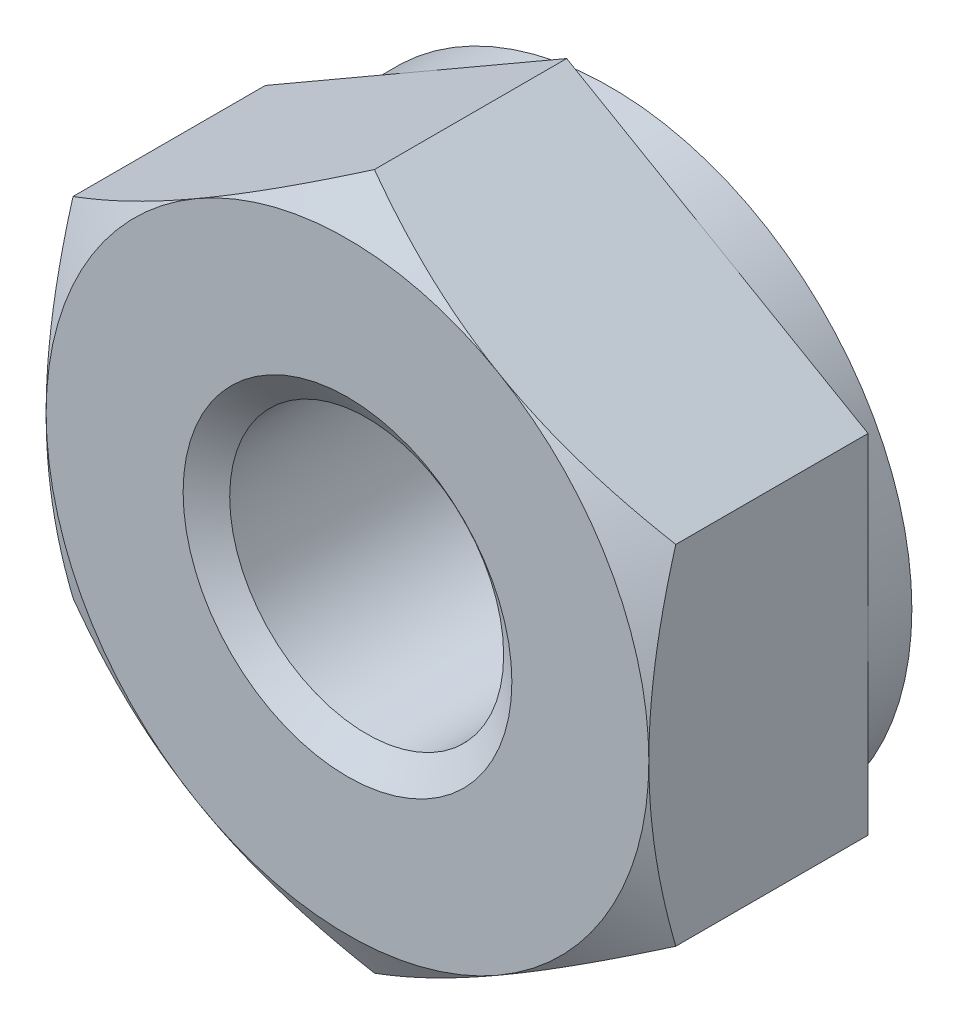
ISO-10303-21;
HEADER;
FILE_DESCRIPTION(('STEP AP214'),'2;1');
FILE_NAME('part.step','',(''),(''),'','','');
FILE_SCHEMA(('AUTOMOTIVE_DESIGN { 1 0 10303 214 1 1 1 1 }'));
ENDSEC;
DATA;
#1=APPLICATION_CONTEXT('core data for automotive mechanical design processes');
#2=APPLICATION_PROTOCOL_DEFINITION('international standard','automotive_design',2000,#1);
#3=PRODUCT_CONTEXT('',#1,'mechanical');
#4=PRODUCT('Part','Part','',(#3));
#5=PRODUCT_RELATED_PRODUCT_CATEGORY('part','',(#4));
#6=PRODUCT_DEFINITION_FORMATION('','',#4);
#7=PRODUCT_DEFINITION_CONTEXT('part definition',#1,'design');
#8=PRODUCT_DEFINITION('design','',#6,#7);
#9=PRODUCT_DEFINITION_SHAPE('','',#8);
#10=(LENGTH_UNIT() NAMED_UNIT(*) SI_UNIT(.MILLI.,.METRE.));
#11=(NAMED_UNIT(*) PLANE_ANGLE_UNIT() SI_UNIT($,.RADIAN.));
#12=(NAMED_UNIT(*) SI_UNIT($,.STERADIAN.) SOLID_ANGLE_UNIT());
#13=UNCERTAINTY_MEASURE_WITH_UNIT(LENGTH_MEASURE(1.E-05),#10,'distance_accuracy_value','');
#14=(GEOMETRIC_REPRESENTATION_CONTEXT(3) GLOBAL_UNCERTAINTY_ASSIGNED_CONTEXT((#13)) GLOBAL_UNIT_ASSIGNED_CONTEXT((#10,
#11,#12)) REPRESENTATION_CONTEXT('',''));
#15=CARTESIAN_POINT('',(0.,0.,0.));
#16=DIRECTION('',(0.,0.,1.));
#17=DIRECTION('',(1.,0.,0.));
#18=AXIS2_PLACEMENT_3D('',#15,#16,#17);
#19=CARTESIAN_POINT('',(0.,3.175426481,-2.));
#20=DIRECTION('',(-0.50000000017207,0.866025403685094,0.));
#21=DIRECTION('',(-0.866025403685094,-0.50000000017207,0.));
#22=AXIS2_PLACEMENT_3D('',#19,#20,#21);
#23=PLANE('',#22);
#24=DIRECTION('',(-0.866025403685094,-0.50000000017207,0.));
#25=VECTOR('',#24,1.);
#26=CARTESIAN_POINT('',(-1.375,2.3815698605,-2.));
#27=LINE('',#26,#25);
#28=CARTESIAN_POINT('',(0.,3.175426481,-2.));
#29=VERTEX_POINT('',#28);
#30=CARTESIAN_POINT('',(-1.37499999978847,2.38156986057573,-2.));
#31=VERTEX_POINT('',#30);
#32=EDGE_CURVE('E150',#29,#31,#27,.T.);
#33=ORIENTED_EDGE('',*,*,#32,.T.);
#34=DIRECTION('',(-0.866025403685094,-0.50000000017207,0.));
#35=VECTOR('',#34,1.);
#36=CARTESIAN_POINT('',(-1.375,2.3815698605,-2.));
#37=LINE('',#36,#35);
#38=CARTESIAN_POINT('',(-2.75,1.58771324,-2.));
#39=VERTEX_POINT('',#38);
#40=EDGE_CURVE('E96',#31,#39,#37,.T.);
#41=ORIENTED_EDGE('',*,*,#40,.T.);
#42=DIRECTION('',(0.,0.,-1.));
#43=VECTOR('',#42,1.);
#44=CARTESIAN_POINT('',(-2.75,1.58771324,-0.994));
#45=LINE('',#44,#43);
#46=CARTESIAN_POINT('',(-2.74999999999382,1.58771323999643,-0.245620093601473));
#47=VERTEX_POINT('',#46);
#48=EDGE_CURVE('E291',#47,#39,#45,.T.);
#49=ORIENTED_EDGE('',*,*,#48,.F.);
#50=CARTESIAN_POINT('',(-2.74999999999408,1.58771324001485,-0.245620093595487));
#51=CARTESIAN_POINT('',(-2.63807558585393,1.65233283066977,-0.208302595833654));
#52=CARTESIAN_POINT('',(-2.52525484078291,1.71746991823363,-0.174113252701895));
#53=CARTESIAN_POINT('',(-2.29861884692482,1.84831827035362,-0.113820961664054));
#54=CARTESIAN_POINT('',(-2.18481150340565,1.91402497080116,-0.0876780282920387));
#55=CARTESIAN_POINT('',(-2.01302642300232,2.01320513326058,-0.0555789446123651));
#56=CARTESIAN_POINT('',(-1.95554772821597,2.04639047318331,-0.0460612395121984));
#57=CARTESIAN_POINT('',(-1.84031516470078,2.11292002477869,-0.029585893585113));
#58=CARTESIAN_POINT('',(-1.78256130325506,2.14626423224644,-0.0226281853771302));
#59=CARTESIAN_POINT('',(-1.66656478203399,2.21323485502923,-0.0113950800491212));
#60=CARTESIAN_POINT('',(-1.60832112391658,2.24686184673733,-0.00713332362364565));
#61=CARTESIAN_POINT('',(-1.49171926126974,2.31418196355538,-0.00142988479068854));
#62=CARTESIAN_POINT('',(-1.43336103634462,2.34787510044078,1.12391100479962E-05));
#63=CARTESIAN_POINT('',(-1.37499999997068,2.38156986051693,-4.63965452587297E-11));
#64=B_SPLINE_CURVE_WITH_KNOTS('',3,(#50,#51,#52,#53,#54,#55,#56,#57,#58,#59,#60,#61,#62,#63),
.UNSPECIFIED.,.F.,.F.,(4,2,2,2,2,2,4),(0.,0.403720162194843,0.805400437977162,1.00650412011461,
1.20760250867155,1.40971042252754,1.61185835124443),.UNSPECIFIED.);
#65=CARTESIAN_POINT('',(-1.37500000021618,2.38156986032879,-2.31983978120266E-11));
#66=VERTEX_POINT('',#65);
#67=EDGE_CURVE('E21',#47,#66,#64,.T.);
#68=ORIENTED_EDGE('',*,*,#67,.T.);
#69=CARTESIAN_POINT('',(-1.37499999994153,2.38156986048153,-7.25108407581807E-11));
#70=CARTESIAN_POINT('',(-1.3166389635855,2.4152646205808,1.1239082818288E-05));
#71=CARTESIAN_POINT('',(-1.25828073867029,2.44895775747422,-0.00142988482870884));
#72=CARTESIAN_POINT('',(-1.14167887603666,2.5162778742947,-0.00713332369117726));
#73=CARTESIAN_POINT('',(-1.08343521792257,2.54990486599721,-0.0113950801353626));
#74=CARTESIAN_POINT('',(-0.967438696710512,2.61687548877209,-0.0226281854972337));
#75=CARTESIAN_POINT('',(-0.909684835270488,2.6502196962375,-0.0295858937203894));
#76=CARTESIAN_POINT('',(-0.794452271766521,2.71674924782719,-0.0460612396771357));
#77=CARTESIAN_POINT('',(-0.736973576985711,2.74993458774655,-0.0555789447917936));
#78=CARTESIAN_POINT('',(-0.565188496599634,2.84911475019532,-0.0876780285121504));
#79=CARTESIAN_POINT('',(-0.451381153092406,2.91482145063526,-0.113820961907656));
#80=CARTESIAN_POINT('',(-0.224745159260682,3.04566980274237,-0.174113252988618));
#81=CARTESIAN_POINT('',(-0.111924414204105,3.11080689030099,-0.20830259613997));
#82=CARTESIAN_POINT('',(-8.02964023947247E-11,3.17542648095364,-0.24562009392108));
#83=B_SPLINE_CURVE_WITH_KNOTS('',3,(#69,#70,#71,#72,#73,#74,#75,#76,#77,#78,#79,#80,#81,#82),
.UNSPECIFIED.,.F.,.F.,(4,2,2,2,2,2,4),(0.,0.202147928703942,0.404255842546314,0.605354231089953,
0.806457913214344,1.20813818896912,1.61185835113543),.UNSPECIFIED.);
#84=CARTESIAN_POINT('',(-4.5674561443607E-11,3.17542648097363,-0.24562009393262));
#85=VERTEX_POINT('',#84);
#86=EDGE_CURVE('E161',#66,#85,#83,.T.);
#87=ORIENTED_EDGE('',*,*,#86,.T.);
#88=DIRECTION('',(0.,0.,1.));
#89=VECTOR('',#88,1.);
#90=CARTESIAN_POINT('',(0.,3.175426481,-0.994));
#91=LINE('',#90,#89);
#92=EDGE_CURVE('E344',#29,#85,#91,.T.);
#93=ORIENTED_EDGE('',*,*,#92,.F.);
#94=EDGE_LOOP('',(#33,#41,#49,#68,#87,#93));
#95=FACE_BOUND('',#94,.T.);
#96=ADVANCED_FACE('F17',(#95),#23,.T.);
#97=CARTESIAN_POINT('',(2.75,1.58771324,-2.));
#98=DIRECTION('',(0.50000000017207,0.866025403685094,0.));
#99=DIRECTION('',(-0.866025403685094,0.50000000017207,0.));
#100=AXIS2_PLACEMENT_3D('',#97,#98,#99);
#101=PLANE('',#100);
#102=DIRECTION('',(-0.866025403685094,0.50000000017207,0.));
#103=VECTOR('',#102,1.);
#104=CARTESIAN_POINT('',(1.375,2.3815698605,-2.));
#105=LINE('',#104,#103);
#106=CARTESIAN_POINT('',(2.75,1.58771324,-2.));
#107=VERTEX_POINT('',#106);
#108=CARTESIAN_POINT('',(1.37500000025669,2.3815698603518,-2.));
#109=VERTEX_POINT('',#108);
#110=EDGE_CURVE('E117',#107,#109,#105,.T.);
#111=ORIENTED_EDGE('',*,*,#110,.T.);
#112=DIRECTION('',(-0.866025403685094,0.50000000017207,0.));
#113=VECTOR('',#112,1.);
#114=CARTESIAN_POINT('',(1.375,2.3815698605,-2.));
#115=LINE('',#114,#113);
#116=EDGE_CURVE('E122',#109,#29,#115,.T.);
#117=ORIENTED_EDGE('',*,*,#116,.T.);
#118=ORIENTED_EDGE('',*,*,#92,.T.);
#119=CARTESIAN_POINT('',(1.168740492773E-10,3.17542648101699,-0.245620093873185));
#120=CARTESIAN_POINT('',(0.111924414193438,3.11080689033638,-0.208302596131383));
#121=CARTESIAN_POINT('',(0.22474515921282,3.04566980277759,-0.174113252999979));
#122=CARTESIAN_POINT('',(0.451381152979366,2.91482145069299,-0.113820961939099));
#123=CARTESIAN_POINT('',(0.565188496458585,2.84911475027562,-0.0876780285438947));
#124=CARTESIAN_POINT('',(0.736973576799712,2.74993458785451,-0.0555789448238476));
#125=CARTESIAN_POINT('',(0.794452271565042,2.71674924794334,-0.0460612397092689));
#126=CARTESIAN_POINT('',(0.909684835038815,2.65021969637144,-0.0295858937501871));
#127=CARTESIAN_POINT('',(0.967438696464126,2.61687548891563,-0.0226281855246216));
#128=CARTESIAN_POINT('',(1.08343521764411,2.54990486615668,-0.0113950801587906));
#129=CARTESIAN_POINT('',(1.14167887574083,2.5162778744605,-0.00713332371303133));
#130=CARTESIAN_POINT('',(1.25828073834696,2.44895775766589,-0.00142988483710704));
#131=CARTESIAN_POINT('',(1.31663896325205,2.41526462079202,1.1239086316254E-05));
#132=CARTESIAN_POINT('',(1.37499999960646,2.38156986072721,-4.63969833336386E-11));
#133=B_SPLINE_CURVE_WITH_KNOTS('',3,(#119,#120,#121,#122,#123,#124,#125,#126,#127,#128,#129,
#130,#131,#132),.UNSPECIFIED.,.F.,.F.,(4,2,2,2,2,2,4),(0.,0.403720162058255,0.805400437709092,
1.00650411978147,1.20760250827348,1.40971042206192,1.61185835071105),.UNSPECIFIED.);
#134=CARTESIAN_POINT('',(1.37499999978848,2.38156986057573,0.));
#135=VERTEX_POINT('',#134);
#136=EDGE_CURVE('E340',#85,#135,#133,.T.);
#137=ORIENTED_EDGE('',*,*,#136,.T.);
#138=CARTESIAN_POINT('',(1.37499999959037,2.38156986068427,-7.25109346528432E-11));
#139=CARTESIAN_POINT('',(1.43336103599134,2.347875100626,1.12391065220599E-05));
#140=CARTESIAN_POINT('',(1.49171926093485,2.3141819637437,-0.00142988478212617));
#141=CARTESIAN_POINT('',(1.60832112361076,2.24686184691892,-0.00713332360090284));
#142=CARTESIAN_POINT('',(1.66656478173883,2.21323485520098,-0.011395080024276));
#143=CARTESIAN_POINT('',(1.78256130298293,2.14626423240222,-0.0226281853470495));
#144=CARTESIAN_POINT('',(1.84031516444101,2.11292002492833,-0.0295858935518867));
#145=CARTESIAN_POINT('',(1.95554772798039,2.04639047331967,-0.0460612394746003));
#146=CARTESIAN_POINT('',(2.01302642277856,2.01320513338981,-0.0555789445735435));
#147=CARTESIAN_POINT('',(2.18481150321716,1.91402497090992,-0.0876780282508544));
#148=CARTESIAN_POINT('',(2.29861884676006,1.84831827044965,-0.113820961623081));
#149=CARTESIAN_POINT('',(2.52525484066373,1.71746991830154,-0.174113252667302));
#150=CARTESIAN_POINT('',(2.63807558575656,1.65233283072226,-0.208302595805303));
#151=CARTESIAN_POINT('',(2.74999999991544,1.58771324004882,-0.24562009357741));
#152=B_SPLINE_CURVE_WITH_KNOTS('',3,(#138,#139,#140,#141,#142,#143,#144,#145,#146,#147,#148,
#149,#150,#151),.UNSPECIFIED.,.F.,.F.,(4,2,2,2,2,2,4),(0.,0.202147928759209,0.404255842656908,
0.60535423125405,0.80645791343191,1.20813818929328,1.61185835156985),.UNSPECIFIED.);
#153=CARTESIAN_POINT('',(2.74999999995873,1.58771324002383,-0.245620093591838));
#154=VERTEX_POINT('',#153);
#155=EDGE_CURVE('E129',#135,#154,#152,.T.);
#156=ORIENTED_EDGE('',*,*,#155,.T.);
#157=DIRECTION('',(0.,0.,-1.));
#158=VECTOR('',#157,1.);
#159=CARTESIAN_POINT('',(2.75,1.58771324,-0.994));
#160=LINE('',#159,#158);
#161=EDGE_CURVE('E125',#154,#107,#160,.T.);
#162=ORIENTED_EDGE('',*,*,#161,.T.);
#163=EDGE_LOOP('',(#111,#117,#118,#137,#156,#162));
#164=FACE_BOUND('',#163,.T.);
#165=ADVANCED_FACE('F119',(#164),#101,.T.);
#166=CARTESIAN_POINT('',(-2.75,-1.58771324,-2.));
#167=DIRECTION('',(-1.,0.,0.));
#168=DIRECTION('',(0.,0.,1.));
#169=AXIS2_PLACEMENT_3D('',#166,#167,#168);
#170=PLANE('',#169);
#171=DIRECTION('',(0.,-1.,0.));
#172=VECTOR('',#171,1.);
#173=CARTESIAN_POINT('',(-2.75,0.,-2.));
#174=LINE('',#173,#172);
#175=CARTESIAN_POINT('',(-2.75,-5.64034428417161E-10,-2.));
#176=VERTEX_POINT('',#175);
#177=EDGE_CURVE('E366',#39,#176,#174,.T.);
#178=ORIENTED_EDGE('',*,*,#177,.T.);
#179=DIRECTION('',(0.,-1.,0.));
#180=VECTOR('',#179,1.);
#181=CARTESIAN_POINT('',(-2.75,0.,-2.));
#182=LINE('',#181,#180);
#183=CARTESIAN_POINT('',(-2.75,-1.58771324,-2.));
#184=VERTEX_POINT('',#183);
#185=EDGE_CURVE('E368',#176,#184,#182,.T.);
#186=ORIENTED_EDGE('',*,*,#185,.T.);
#187=DIRECTION('',(0.,0.,-1.));
#188=VECTOR('',#187,1.);
#189=CARTESIAN_POINT('',(-2.75,-1.58771324,-0.994));
#190=LINE('',#189,#188);
#191=CARTESIAN_POINT('',(-2.75,-1.58771323988148,-0.245620093571383));
#192=VERTEX_POINT('',#191);
#193=EDGE_CURVE('E382',#192,#184,#190,.T.);
#194=ORIENTED_EDGE('',*,*,#193,.F.);
#195=CARTESIAN_POINT('',(-2.75,-1.58771323976296,-0.24562009353717));
#196=CARTESIAN_POINT('',(-2.75,-1.45847405854946,-0.208302595790007));
#197=CARTESIAN_POINT('',(-2.75,-1.32819988352562,-0.174113252672425));
#198=CARTESIAN_POINT('',(-2.75,-1.06650317949965,-0.113820961656727));
#199=CARTESIAN_POINT('',(-2.75,-0.935089778714638,-0.0876780282927506));
#200=CARTESIAN_POINT('',(-2.75,-0.736729453960993,-0.0555789446170869));
#201=CARTESIAN_POINT('',(-2.75,-0.670358774170732,-0.0460612395169194));
#202=CARTESIAN_POINT('',(-2.75,-0.537299671090709,-0.0295858935871602));
#203=CARTESIAN_POINT('',(-2.75,-0.470611256210784,-0.022628185376504));
#204=CARTESIAN_POINT('',(-2.75,-0.336670010756947,-0.0113950800403112));
#205=CARTESIAN_POINT('',(-2.75,-0.269416027396935,-0.00713332360929719));
#206=CARTESIAN_POINT('',(-2.75,-0.134775793873023,-0.00142988476242685));
#207=CARTESIAN_POINT('',(-2.75,-0.0673895201582297,1.12391466847842E-05));
#208=CARTESIAN_POINT('',(-2.75,-6.17332068107848E-11,0.));
#209=B_SPLINE_CURVE_WITH_KNOTS('',3,(#195,#196,#197,#198,#199,#200,#201,#202,#203,#204,#205,
#206,#207,#208),.UNSPECIFIED.,.F.,.F.,(4,2,2,2,2,2,4),(0.,0.403720162000382,0.805400437591287,
1.00650411963245,1.20760250809309,1.40971042185127,1.61185835047036),.UNSPECIFIED.);
#210=CARTESIAN_POINT('',(-2.75,-2.46932478179016E-10,0.));
#211=VERTEX_POINT('',#210);
#212=EDGE_CURVE('E151',#192,#211,#209,.T.);
#213=ORIENTED_EDGE('',*,*,#212,.T.);
#214=CARTESIAN_POINT('',(-2.75,-6.17332037415705E-11,0.));
#215=CARTESIAN_POINT('',(-2.75,0.0673895200497917,1.12391484421523E-05));
#216=CARTESIAN_POINT('',(-2.75,0.134775793779649,-0.00142988475957088));
#217=CARTESIAN_POINT('',(-2.75,0.26941602733367,-0.00713332360552512));
#218=CARTESIAN_POINT('',(-2.75,0.336670010708725,-0.011395080036721));
#219=CARTESIAN_POINT('',(-2.75,0.470611256192358,-0.0226281853745066));
#220=CARTESIAN_POINT('',(-2.75,0.537299671087036,-0.0295858935865623));
#221=CARTESIAN_POINT('',(-2.75,0.670358774196418,-0.0460612395202435));
#222=CARTESIAN_POINT('',(-2.75,0.736729454001287,-0.0555789446229336));
#223=CARTESIAN_POINT('',(-2.75,0.935089778798327,-0.0876780283076373));
#224=CARTESIAN_POINT('',(-2.75,1.06650317961185,-0.113820961679616));
#225=CARTESIAN_POINT('',(-2.75,1.32819988369441,-0.174113252714297));
#226=CARTESIAN_POINT('',(-2.75,1.45847405874632,-0.208302595842892));
#227=CARTESIAN_POINT('',(-2.75,1.58771323998745,-0.245620093601972));
#228=B_SPLINE_CURVE_WITH_KNOTS('',3,(#214,#215,#216,#217,#218,#219,#220,#221,#222,#223,#224,
#225,#226,#227),.UNSPECIFIED.,.F.,.F.,(4,2,2,2,2,2,4),(0.,0.202147928664163,0.404255842467386,
0.605354230972441,0.806457913058028,1.20813818873734,1.61185835082738),.UNSPECIFIED.);
#229=EDGE_CURVE('E87',#211,#47,#228,.T.);
#230=ORIENTED_EDGE('',*,*,#229,.T.);
#231=ORIENTED_EDGE('',*,*,#48,.T.);
#232=EDGE_LOOP('',(#178,#186,#194,#213,#230,#231));
#233=FACE_BOUND('',#232,.T.);
#234=ADVANCED_FACE('F302',(#233),#170,.T.);
#235=CARTESIAN_POINT('',(2.75,-1.58771324,-2.));
#236=DIRECTION('',(-1.,0.,0.));
#237=DIRECTION('',(0.,0.,1.));
#238=AXIS2_PLACEMENT_3D('',#235,#236,#237);
#239=PLANE('',#238);
#240=DIRECTION('',(0.,0.,1.));
#241=VECTOR('',#240,1.);
#242=CARTESIAN_POINT('',(2.75,-1.58771324,-0.994));
#243=LINE('',#242,#241);
#244=CARTESIAN_POINT('',(2.75,-1.58771324020756,-2.));
#245=VERTEX_POINT('',#244);
#246=CARTESIAN_POINT('',(2.75,-1.58771323994002,-0.245620093588282));
#247=VERTEX_POINT('',#246);
#248=EDGE_CURVE('E398',#245,#247,#243,.T.);
#249=ORIENTED_EDGE('',*,*,#248,.F.);
#250=DIRECTION('',(0.,-1.,0.));
#251=VECTOR('',#250,1.);
#252=CARTESIAN_POINT('',(2.75,0.,-2.));
#253=LINE('',#252,#251);
#254=CARTESIAN_POINT('',(2.75,-2.46932478179016E-10,-2.));
#255=VERTEX_POINT('',#254);
#256=EDGE_CURVE('E381',#255,#245,#253,.T.);
#257=ORIENTED_EDGE('',*,*,#256,.F.);
#258=DIRECTION('',(0.,-1.,0.));
#259=VECTOR('',#258,1.);
#260=CARTESIAN_POINT('',(2.75,0.,-2.));
#261=LINE('',#260,#259);
#262=EDGE_CURVE('E135',#107,#255,#261,.T.);
#263=ORIENTED_EDGE('',*,*,#262,.F.);
#264=ORIENTED_EDGE('',*,*,#161,.F.);
#265=CARTESIAN_POINT('',(2.74999999996589,1.58771323996527,-0.245620093617902));
#266=CARTESIAN_POINT('',(2.74999999998809,1.45847405868834,-0.208302595834216));
#267=CARTESIAN_POINT('',(2.74999999999689,1.32819988359778,-0.174113252691126));
#268=CARTESIAN_POINT('',(2.7500000000031,1.06650317943598,-0.113820961639992));
#269=CARTESIAN_POINT('',(2.75000000000057,0.935089778581892,-0.0876780282659507));
#270=CARTESIAN_POINT('',(2.74999999999972,0.736729453724058,-0.0555789445814116));
#271=CARTESIAN_POINT('',(2.74999999999992,0.670358773898968,-0.0460612394793252));
#272=CARTESIAN_POINT('',(2.75000000000008,0.537299670749068,-0.029585893548802));
#273=CARTESIAN_POINT('',(2.75000000000002,0.470611255834092,-0.0226281853392994));
#274=CARTESIAN_POINT('',(2.74999999999998,0.336670010309452,-0.0113950800084129));
#275=CARTESIAN_POINT('',(2.74999999999999,0.269416026913686,-0.00713332358158737));
#276=CARTESIAN_POINT('',(2.75000000000001,0.134775793318369,-0.00142988474621763));
#277=CARTESIAN_POINT('',(2.75000000000002,0.0673895195679267,1.12391555787023E-05));
#278=CARTESIAN_POINT('',(2.75,-5.64033977567808E-10,0.));
#279=B_SPLINE_CURVE_WITH_KNOTS('',3,(#265,#266,#267,#268,#269,#270,#271,#272,#273,#274,#275,
#276,#277,#278),.UNSPECIFIED.,.F.,.F.,(4,2,2,2,2,2,4),(0.,0.403720162212824,0.805400438012124,
1.00650412015749,1.20760250872225,1.40971042258659,1.61185835131204),.UNSPECIFIED.);
#280=CARTESIAN_POINT('',(2.75,-8.46050726700331E-10,0.));
#281=VERTEX_POINT('',#280);
#282=EDGE_CURVE('E292',#154,#281,#279,.T.);
#283=ORIENTED_EDGE('',*,*,#282,.T.);
#284=CARTESIAN_POINT('',(2.75,-5.64033817811667E-10,0.));
#285=CARTESIAN_POINT('',(2.75,-0.0673895206444486,1.12391395647594E-05));
#286=CARTESIAN_POINT('',(2.75,-0.134775794343004,-0.00142988477595771));
#287=CARTESIAN_POINT('',(2.75,-0.269416027834243,-0.00713332363415822));
#288=CARTESIAN_POINT('',(2.75,-0.336670011177819,-0.0113950800700919));
#289=CARTESIAN_POINT('',(2.75,-0.470611256598998,-0.0226281854145606));
#290=CARTESIAN_POINT('',(2.75,-0.537299671462701,-0.0295858936285899));
#291=CARTESIAN_POINT('',(2.75,-0.670358774510289,-0.0460612395635949));
#292=CARTESIAN_POINT('',(2.75,-0.736729454284339,-0.0555789446656351));
#293=CARTESIAN_POINT('',(2.75,-0.935089778989635,-0.0876780283447839));
#294=CARTESIAN_POINT('',(2.75,-1.06650317974266,-0.113820961708242));
#295=CARTESIAN_POINT('',(2.75,-1.32819988370479,-0.174113252718213));
#296=CARTESIAN_POINT('',(2.75,-1.4584740586968,-0.208302595830538));
#297=CARTESIAN_POINT('',(2.75,-1.58771323987907,-0.245620093570687));
#298=B_SPLINE_CURVE_WITH_KNOTS('',3,(#284,#285,#286,#287,#288,#289,#290,#291,#292,#293,#294,
#295,#296,#297),.UNSPECIFIED.,.F.,.F.,(4,2,2,2,2,2,4),(0.,0.20214792857085,0.404255842280809,
0.605354230694139,0.806457912688001,1.20813818818473,1.61185835008907),.UNSPECIFIED.);
#299=EDGE_CURVE('E313',#281,#247,#298,.T.);
#300=ORIENTED_EDGE('',*,*,#299,.T.);
#301=EDGE_LOOP('',(#249,#257,#263,#264,#283,#300));
#302=FACE_BOUND('',#301,.T.);
#303=ADVANCED_FACE('F306',(#302),#239,.F.);
#304=CARTESIAN_POINT('',(-2.75,-1.58771324,-2.));
#305=DIRECTION('',(-0.50000000017207,-0.866025403685094,0.));
#306=DIRECTION('',(0.866025403685094,-0.50000000017207,0.));
#307=AXIS2_PLACEMENT_3D('',#304,#305,#306);
#308=PLANE('',#307);
#309=DIRECTION('',(0.866025403685094,-0.50000000017207,0.));
#310=VECTOR('',#309,1.);
#311=CARTESIAN_POINT('',(-1.375,-2.3815698605,-2.));
#312=LINE('',#311,#310);
#313=CARTESIAN_POINT('',(-1.37500000000232,-2.38156986045226,-2.));
#314=VERTEX_POINT('',#313);
#315=EDGE_CURVE('E390',#184,#314,#312,.T.);
#316=ORIENTED_EDGE('',*,*,#315,.T.);
#317=DIRECTION('',(0.866025403685094,-0.50000000017207,0.));
#318=VECTOR('',#317,1.);
#319=CARTESIAN_POINT('',(-1.375,-2.3815698605,-2.));
#320=LINE('',#319,#318);
#321=CARTESIAN_POINT('',(-3.95889375968961E-10,-3.17542648077143,-2.));
#322=VERTEX_POINT('',#321);
#323=EDGE_CURVE('E387',#314,#322,#320,.T.);
#324=ORIENTED_EDGE('',*,*,#323,.T.);
#325=DIRECTION('',(0.,0.,-1.));
#326=VECTOR('',#325,1.);
#327=CARTESIAN_POINT('',(0.,-3.175426481,-0.994));
#328=LINE('',#327,#326);
#329=CARTESIAN_POINT('',(1.69138277596151E-10,-3.17542648089602,-0.245620093887811));
#330=VERTEX_POINT('',#329);
#331=EDGE_CURVE('E204',#330,#322,#328,.T.);
#332=ORIENTED_EDGE('',*,*,#331,.F.);
#333=CARTESIAN_POINT('',(9.98245822792499E-12,-3.17542648093644,-0.245620093980472));
#334=CARTESIAN_POINT('',(-0.111924414126867,-3.1108068903211,-0.208302596174666));
#335=CARTESIAN_POINT('',(-0.224745159188074,-3.04566980277783,-0.174113253012557));
#336=CARTESIAN_POINT('',(-0.4513811530218,-2.91482145068246,-0.113820961921846));
#337=CARTESIAN_POINT('',(-0.565188496526437,-2.84911475023901,-0.0876780285272892));
#338=CARTESIAN_POINT('',(-0.736973576909811,-2.74993458778966,-0.0555789448052432));
#339=CARTESIAN_POINT('',(-0.794452271689671,-2.71674924787104,-0.0460612396895269));
#340=CARTESIAN_POINT('',(-0.909684835192113,-2.65021969628328,-0.0295858937301916));
#341=CARTESIAN_POINT('',(-0.967438696631564,-2.61687548881906,-0.0226281855055058));
#342=CARTESIAN_POINT('',(-1.08343521784055,-2.54990486604317,-0.0113950801426776));
#343=CARTESIAN_POINT('',(-1.14167887595214,-2.51627787433845,-0.00713332369907431));
#344=CARTESIAN_POINT('',(-1.25828073858811,-2.44895775752671,-0.00142988482895658));
#345=CARTESIAN_POINT('',(-1.31663896350816,-2.41526462064426,1.12390908078984E-05));
#346=CARTESIAN_POINT('',(-1.3749999998774,-2.38156986057078,-4.63970459488052E-11));
#347=B_SPLINE_CURVE_WITH_KNOTS('',3,(#333,#334,#335,#336,#337,#338,#339,#340,#341,#342,#343,
#344,#345,#346),.UNSPECIFIED.,.F.,.F.,(4,2,2,2,2,2,4),(0.,0.403720162163799,0.805400437916087,
1.00650412003751,1.20760250857823,1.40971042241756,1.61185835111816),.UNSPECIFIED.);
#348=CARTESIAN_POINT('',(-1.37499999995895,-2.3815698604773,-2.31984291102475E-11));
#349=VERTEX_POINT('',#348);
#350=EDGE_CURVE('E319',#330,#349,#347,.T.);
#351=ORIENTED_EDGE('',*,*,#350,.T.);
#352=CARTESIAN_POINT('',(-1.3749999998774,-2.38156986057078,-4.6396858220495E-11));
#353=CARTESIAN_POINT('',(-1.43336103625958,-2.34787510048989,1.12391115823714E-05));
#354=CARTESIAN_POINT('',(-1.49171926119294,-2.31418196359972,-0.00142988478804209));
#355=CARTESIAN_POINT('',(-1.60832112385629,-2.24686184677213,-0.00713332361959418));
#356=CARTESIAN_POINT('',(-1.66656478198195,-2.21323485505927,-0.0113950800447758));
#357=CARTESIAN_POINT('',(-1.78256130321934,-2.14626423226707,-0.0226281853729787));
#358=CARTESIAN_POINT('',(-1.84031516467314,-2.11292002479468,-0.0295858935814404));
#359=CARTESIAN_POINT('',(-1.95554772820438,-2.04639047318998,-0.0460612395102614));
#360=CARTESIAN_POINT('',(-2.0130264229987,-2.01320513326258,-0.0555789446116853));
#361=CARTESIAN_POINT('',(-2.18481150342606,-1.91402497078957,-0.0876780282958561));
#362=CARTESIAN_POINT('',(-2.29861884696142,-1.84831827033352,-0.113820961671836));
#363=CARTESIAN_POINT('',(-2.52525484084966,-1.71746991819405,-0.174113252721622));
#364=CARTESIAN_POINT('',(-2.63807558593462,-1.65233283061919,-0.208302595861395));
#365=CARTESIAN_POINT('',(-2.75000000008596,-1.58771323995037,-0.245620093634249));
#366=B_SPLINE_CURVE_WITH_KNOTS('',3,(#352,#353,#354,#355,#356,#357,#358,#359,#360,#361,#362,
#363,#364,#365),.UNSPECIFIED.,.F.,.F.,(4,2,2,2,2,2,4),(0.,0.202147928745394,0.40425584262982,
0.605354231214688,0.806457913380084,1.20813818921832,1.61185835147009),.UNSPECIFIED.);
#367=EDGE_CURVE('E401',#349,#192,#366,.T.);
#368=ORIENTED_EDGE('',*,*,#367,.T.);
#369=ORIENTED_EDGE('',*,*,#193,.T.);
#370=EDGE_LOOP('',(#316,#324,#332,#351,#368,#369));
#371=FACE_BOUND('',#370,.T.);
#372=ADVANCED_FACE('F230',(#371),#308,.T.);
#373=CARTESIAN_POINT('',(0.,0.,0.));
#374=DIRECTION('',(0.,0.,-1.));
#375=DIRECTION('',(-1.,0.,0.));
#376=AXIS2_PLACEMENT_3D('',#373,#374,#375);
#377=CONICAL_SURFACE('',#376,2.75,1.04719755009987);
#378=ORIENTED_EDGE('',*,*,#136,.F.);
#379=ORIENTED_EDGE('',*,*,#86,.F.);
#380=CARTESIAN_POINT('',(0.,0.,0.));
#381=DIRECTION('',(0.,0.,-1.));
#382=DIRECTION('',(-1.,0.,0.));
#383=AXIS2_PLACEMENT_3D('',#380,#381,#382);
#384=CIRCLE('',#383,2.75);
#385=EDGE_CURVE('E201',#66,#135,#384,.T.);
#386=ORIENTED_EDGE('',*,*,#385,.T.);
#387=EDGE_LOOP('',(#378,#379,#386));
#388=FACE_BOUND('',#387,.T.);
#389=ADVANCED_FACE('F332',(#388),#377,.T.);
#390=CARTESIAN_POINT('',(0.,0.,0.));
#391=DIRECTION('',(0.,0.,-1.));
#392=DIRECTION('',(-1.,0.,0.));
#393=AXIS2_PLACEMENT_3D('',#390,#391,#392);
#394=CONICAL_SURFACE('',#393,2.75,1.04719755009987);
#395=ORIENTED_EDGE('',*,*,#282,.F.);
#396=ORIENTED_EDGE('',*,*,#155,.F.);
#397=CARTESIAN_POINT('',(0.,0.,0.));
#398=DIRECTION('',(0.,0.,-1.));
#399=DIRECTION('',(-1.,0.,0.));
#400=AXIS2_PLACEMENT_3D('',#397,#398,#399);
#401=CIRCLE('',#400,2.75);
#402=EDGE_CURVE('E198',#135,#281,#401,.T.);
#403=ORIENTED_EDGE('',*,*,#402,.T.);
#404=EDGE_LOOP('',(#395,#396,#403));
#405=FACE_BOUND('',#404,.T.);
#406=ADVANCED_FACE('F326',(#405),#394,.T.);
#407=CARTESIAN_POINT('',(0.,0.,0.));
#408=DIRECTION('',(0.,0.,-1.));
#409=DIRECTION('',(-1.,0.,0.));
#410=AXIS2_PLACEMENT_3D('',#407,#408,#409);
#411=CONICAL_SURFACE('',#410,2.75,1.04719755009987);
#412=CARTESIAN_POINT('',(0.,0.,0.));
#413=DIRECTION('',(0.,0.,-1.));
#414=DIRECTION('',(-1.,0.,0.));
#415=AXIS2_PLACEMENT_3D('',#412,#413,#414);
#416=CIRCLE('',#415,2.75);
#417=CARTESIAN_POINT('',(1.37500000000232,-2.38156986045226,0.));
#418=VERTEX_POINT('',#417);
#419=EDGE_CURVE('E195',#281,#418,#416,.T.);
#420=ORIENTED_EDGE('',*,*,#419,.T.);
#421=CARTESIAN_POINT('',(2.74999999996919,-1.58771323996951,-0.245620093629669));
#422=CARTESIAN_POINT('',(2.63807558582987,-1.6523328306628,-0.208302595840291));
#423=CARTESIAN_POINT('',(2.52525484074637,-1.71746991824928,-0.174113252694498));
#424=CARTESIAN_POINT('',(2.29861884685238,-1.84831827040087,-0.113820961642464));
#425=CARTESIAN_POINT('',(2.18481150330986,-1.91402497085747,-0.0876780282701859));
#426=CARTESIAN_POINT('',(2.01302642287424,-2.01320513333404,-0.0555789445904122));
#427=CARTESIAN_POINT('',(1.95554772807767,-2.04639047326303,-0.0460612394902704));
#428=CARTESIAN_POINT('',(1.84031516454177,-2.11292002487063,-0.0295858935645324));
#429=CARTESIAN_POINT('',(1.78256130308558,-2.14626423234432,-0.0226281853578702));
#430=CARTESIAN_POINT('',(1.6665647818433,-2.21323485513928,-0.0113950800335114));
#431=CARTESIAN_POINT('',(1.60832112371517,-2.24686184685359,-0.00713332361038394));
#432=CARTESIAN_POINT('',(1.49171926104688,-2.31418196368406,-0.00142988478322015));
#433=CARTESIAN_POINT('',(1.43336103611106,-2.34787510057566,1.1239114067757E-05));
#434=CARTESIAN_POINT('',(1.37499999972644,-2.38156986065794,-4.63967330649342E-11));
#435=B_SPLINE_CURVE_WITH_KNOTS('',3,(#421,#422,#423,#424,#425,#426,#427,#428,#429,#430,#431,
#432,#433,#434),.UNSPECIFIED.,.F.,.F.,(4,2,2,2,2,2,4),(0.,0.403720162269446,0.805400438124148,
1.00650412029721,1.20760250888964,1.40971042278227,1.61185835153604),.UNSPECIFIED.);
#436=EDGE_CURVE('E213',#247,#418,#435,.T.);
#437=ORIENTED_EDGE('',*,*,#436,.F.);
#438=ORIENTED_EDGE('',*,*,#299,.F.);
#439=EDGE_LOOP('',(#420,#437,#438));
#440=FACE_BOUND('',#439,.T.);
#441=ADVANCED_FACE('F323',(#440),#411,.T.);
#442=CARTESIAN_POINT('',(0.,0.,0.));
#443=DIRECTION('',(0.,0.,-1.));
#444=DIRECTION('',(-1.,0.,0.));
#445=AXIS2_PLACEMENT_3D('',#442,#443,#444);
#446=CONICAL_SURFACE('',#445,2.75,1.04719755009987);
#447=ORIENTED_EDGE('',*,*,#350,.F.);
#448=CARTESIAN_POINT('',(1.3749999996973,-2.38156986062254,-7.25108485827359E-11));
#449=CARTESIAN_POINT('',(1.31663896336292,-2.41526462070931,1.12390788102777E-05));
#450=CARTESIAN_POINT('',(1.25828073846943,-2.44895775759018,-0.00142988483562802));
#451=CARTESIAN_POINT('',(1.14167887587926,-2.51627787438557,-0.00713332370176253));
#452=CARTESIAN_POINT('',(1.0834352177869,-2.54990486607553,-0.0113950801467038));
#453=CARTESIAN_POINT('',(0.967438696617918,-2.61687548882555,-0.0226281855079906));
#454=CARTESIAN_POINT('',(0.909684835199226,-2.65021969627864,-0.0295858937298263));
#455=CARTESIAN_POINT('',(0.794452271737743,-2.71674924784381,-0.046061239682002));
#456=CARTESIAN_POINT('',(0.736973576978083,-2.74993458775096,-0.0555789447934093));
#457=CARTESIAN_POINT('',(0.56518849665487,-2.84911475016343,-0.0876780285014497));
#458=CARTESIAN_POINT('',(0.45138115318898,-2.9148214505795,-0.113820961885307));
#459=CARTESIAN_POINT('',(0.224745159439379,-3.0456698026392,-0.174113252937706));
#460=CARTESIAN_POINT('',(0.111924414423574,-3.11080689017428,-0.208302596072089));
#461=CARTESIAN_POINT('',(3.39855743668144E-10,-3.17542648080378,-0.24562009383456));
#462=B_SPLINE_CURVE_WITH_KNOTS('',3,(#448,#449,#450,#451,#452,#453,#454,#455,#456,#457,#458,
#459,#460,#461),.UNSPECIFIED.,.F.,.F.,(4,2,2,2,2,2,4),(0.,0.202147928628955,0.404255842396395,
0.605354230866185,0.80645791291672,1.20813818852451,1.61185835054164),.UNSPECIFIED.);
#463=EDGE_CURVE('E205',#418,#330,#462,.T.);
#464=ORIENTED_EDGE('',*,*,#463,.F.);
#465=CARTESIAN_POINT('',(0.,0.,0.));
#466=DIRECTION('',(0.,0.,-1.));
#467=DIRECTION('',(-1.,0.,0.));
#468=AXIS2_PLACEMENT_3D('',#465,#466,#467);
#469=CIRCLE('',#468,2.75);
#470=EDGE_CURVE('E192',#418,#349,#469,.T.);
#471=ORIENTED_EDGE('',*,*,#470,.T.);
#472=EDGE_LOOP('',(#447,#464,#471));
#473=FACE_BOUND('',#472,.T.);
#474=ADVANCED_FACE('F219',(#473),#446,.T.);
#475=CARTESIAN_POINT('',(0.,0.,0.));
#476=DIRECTION('',(0.,0.,-1.));
#477=DIRECTION('',(-1.,0.,0.));
#478=AXIS2_PLACEMENT_3D('',#475,#476,#477);
#479=CONICAL_SURFACE('',#478,2.75,1.04719755009987);
#480=ORIENTED_EDGE('',*,*,#212,.F.);
#481=ORIENTED_EDGE('',*,*,#367,.F.);
#482=CARTESIAN_POINT('',(0.,0.,0.));
#483=DIRECTION('',(0.,0.,-1.));
#484=DIRECTION('',(-1.,0.,0.));
#485=AXIS2_PLACEMENT_3D('',#482,#483,#484);
#486=CIRCLE('',#485,2.75);
#487=EDGE_CURVE('E189',#349,#211,#486,.T.);
#488=ORIENTED_EDGE('',*,*,#487,.T.);
#489=EDGE_LOOP('',(#480,#481,#488));
#490=FACE_BOUND('',#489,.T.);
#491=ADVANCED_FACE('F281',(#490),#479,.T.);
#492=CARTESIAN_POINT('',(0.,0.,0.));
#493=DIRECTION('',(0.,0.,-1.));
#494=DIRECTION('',(-1.,0.,0.));
#495=AXIS2_PLACEMENT_3D('',#492,#493,#494);
#496=CONICAL_SURFACE('',#495,2.75,1.04719755009987);
#497=CARTESIAN_POINT('',(0.,0.,0.));
#498=DIRECTION('',(0.,0.,-1.));
#499=DIRECTION('',(-1.,0.,0.));
#500=AXIS2_PLACEMENT_3D('',#497,#498,#499);
#501=CIRCLE('',#500,2.75);
#502=EDGE_CURVE('E186',#211,#66,#501,.T.);
#503=ORIENTED_EDGE('',*,*,#502,.T.);
#504=ORIENTED_EDGE('',*,*,#67,.F.);
#505=ORIENTED_EDGE('',*,*,#229,.F.);
#506=EDGE_LOOP('',(#503,#504,#505));
#507=FACE_BOUND('',#506,.T.);
#508=ADVANCED_FACE('F228',(#507),#496,.T.);
#509=CARTESIAN_POINT('',(0.,-3.175426481,-2.));
#510=DIRECTION('',(0.50000000017207,-0.866025403685094,0.));
#511=DIRECTION('',(0.866025403685094,0.50000000017207,0.));
#512=AXIS2_PLACEMENT_3D('',#509,#510,#511);
#513=PLANE('',#512);
#514=DIRECTION('',(-0.866025403940034,-0.4999999997305,0.));
#515=VECTOR('',#514,1.);
#516=CARTESIAN_POINT('',(1.374999999318,-2.38156986091427,-2.));
#517=LINE('',#516,#515);
#518=CARTESIAN_POINT('',(1.37499999985335,-2.38156986058271,-2.));
#519=VERTEX_POINT('',#518);
#520=EDGE_CURVE('E183',#519,#322,#517,.T.);
#521=ORIENTED_EDGE('',*,*,#520,.F.);
#522=DIRECTION('',(-0.866025403804972,-0.499999999964434,0.));
#523=VECTOR('',#522,1.);
#524=CARTESIAN_POINT('',(2.75,-1.58771324041511,-2.));
#525=LINE('',#524,#523);
#526=EDGE_CURVE('E41',#245,#519,#525,.T.);
#527=ORIENTED_EDGE('',*,*,#526,.F.);
#528=ORIENTED_EDGE('',*,*,#248,.T.);
#529=ORIENTED_EDGE('',*,*,#436,.T.);
#530=ORIENTED_EDGE('',*,*,#463,.T.);
#531=ORIENTED_EDGE('',*,*,#331,.T.);
#532=EDGE_LOOP('',(#521,#527,#528,#529,#530,#531));
#533=FACE_BOUND('',#532,.T.);
#534=ADVANCED_FACE('F222',(#533),#513,.T.);
#535=CARTESIAN_POINT('',(2.783,-2.783,0.));
#536=DIRECTION('',(0.,0.,-1.));
#537=DIRECTION('',(-1.,0.,0.));
#538=AXIS2_PLACEMENT_3D('',#535,#536,#537);
#539=PLANE('',#538);
#540=CARTESIAN_POINT('',(0.,0.,0.));
#541=DIRECTION('',(0.,0.,1.));
#542=DIRECTION('',(1.,0.,0.));
#543=AXIS2_PLACEMENT_3D('',#540,#541,#542);
#544=CIRCLE('',#543,1.5);
#545=CARTESIAN_POINT('',(1.5,0.,0.));
#546=VERTEX_POINT('',#545);
#547=EDGE_CURVE('E139',#546,#546,#544,.T.);
#548=ORIENTED_EDGE('',*,*,#547,.F.);
#549=EDGE_LOOP('',(#548));
#550=FACE_BOUND('',#549,.T.);
#551=ORIENTED_EDGE('',*,*,#487,.F.);
#552=ORIENTED_EDGE('',*,*,#470,.F.);
#553=ORIENTED_EDGE('',*,*,#419,.F.);
#554=ORIENTED_EDGE('',*,*,#402,.F.);
#555=ORIENTED_EDGE('',*,*,#385,.F.);
#556=ORIENTED_EDGE('',*,*,#502,.F.);
#557=EDGE_LOOP('',(#551,#552,#553,#554,#555,#556));
#558=FACE_BOUND('',#557,.T.);
#559=ADVANCED_FACE('F227',(#550,#558),#539,.F.);
#560=CARTESIAN_POINT('',(2.75,-0.014289419,-2.));
#561=DIRECTION('',(0.,0.,-1.));
#562=DIRECTION('',(-1.,0.,0.));
#563=AXIS2_PLACEMENT_3D('',#560,#561,#562);
#564=PLANE('',#563);
#565=CARTESIAN_POINT('',(0.,0.,-2.));
#566=DIRECTION('',(0.,0.,1.));
#567=DIRECTION('',(1.,0.,0.));
#568=AXIS2_PLACEMENT_3D('',#565,#566,#567);
#569=CIRCLE('',#568,2.75);
#570=EDGE_CURVE('E132',#255,#109,#569,.T.);
#571=ORIENTED_EDGE('',*,*,#570,.T.);
#572=ORIENTED_EDGE('',*,*,#110,.F.);
#573=ORIENTED_EDGE('',*,*,#262,.T.);
#574=EDGE_LOOP('',(#571,#572,#573));
#575=FACE_BOUND('',#574,.T.);
#576=ADVANCED_FACE('F134',(#575),#564,.T.);
#577=CARTESIAN_POINT('',(1.3915,2.376806721,-2.));
#578=DIRECTION('',(0.,0.,-1.));
#579=DIRECTION('',(-1.,0.,0.));
#580=AXIS2_PLACEMENT_3D('',#577,#578,#579);
#581=PLANE('',#580);
#582=ORIENTED_EDGE('',*,*,#32,.F.);
#583=ORIENTED_EDGE('',*,*,#116,.F.);
#584=CARTESIAN_POINT('',(0.,0.,-2.));
#585=DIRECTION('',(0.,0.,1.));
#586=DIRECTION('',(1.,0.,0.));
#587=AXIS2_PLACEMENT_3D('',#584,#585,#586);
#588=CIRCLE('',#587,2.75);
#589=EDGE_CURVE('E138',#109,#31,#588,.T.);
#590=ORIENTED_EDGE('',*,*,#589,.T.);
#591=EDGE_LOOP('',(#582,#583,#590));
#592=FACE_BOUND('',#591,.T.);
#593=ADVANCED_FACE('F149',(#592),#581,.T.);
#594=CARTESIAN_POINT('',(-1.36675,-0.014289419,-2.));
#595=DIRECTION('',(0.,0.,-1.));
#596=DIRECTION('',(-1.,0.,0.));
#597=AXIS2_PLACEMENT_3D('',#594,#595,#596);
#598=PLANE('',#597);
#599=ORIENTED_EDGE('',*,*,#177,.F.);
#600=ORIENTED_EDGE('',*,*,#40,.F.);
#601=CARTESIAN_POINT('',(0.,0.,-2.));
#602=DIRECTION('',(0.,0.,1.));
#603=DIRECTION('',(1.,0.,0.));
#604=AXIS2_PLACEMENT_3D('',#601,#602,#603);
#605=CIRCLE('',#604,2.75);
#606=EDGE_CURVE('E146',#31,#176,#605,.T.);
#607=ORIENTED_EDGE('',*,*,#606,.T.);
#608=EDGE_LOOP('',(#599,#600,#607));
#609=FACE_BOUND('',#608,.T.);
#610=ADVANCED_FACE('F241',(#609),#598,.T.);
#611=CARTESIAN_POINT('',(-1.36675,-2.39585928,-2.));
#612=DIRECTION('',(0.,0.,-1.));
#613=DIRECTION('',(-1.,0.,0.));
#614=AXIS2_PLACEMENT_3D('',#611,#612,#613);
#615=PLANE('',#614);
#616=CARTESIAN_POINT('',(0.,0.,-2.));
#617=DIRECTION('',(0.,0.,1.));
#618=DIRECTION('',(1.,0.,0.));
#619=AXIS2_PLACEMENT_3D('',#616,#617,#618);
#620=CIRCLE('',#619,2.75);
#621=EDGE_CURVE('E176',#176,#314,#620,.T.);
#622=ORIENTED_EDGE('',*,*,#621,.T.);
#623=ORIENTED_EDGE('',*,*,#315,.F.);
#624=ORIENTED_EDGE('',*,*,#185,.F.);
#625=EDGE_LOOP('',(#622,#623,#624));
#626=FACE_BOUND('',#625,.T.);
#627=ADVANCED_FACE('F244',(#626),#615,.T.);
#628=CARTESIAN_POINT('',(1.3915,-3.18018962,-2.));
#629=DIRECTION('',(0.,0.,-1.));
#630=DIRECTION('',(-1.,0.,0.));
#631=AXIS2_PLACEMENT_3D('',#628,#629,#630);
#632=PLANE('',#631);
#633=CARTESIAN_POINT('',(0.,0.,-2.));
#634=DIRECTION('',(0.,0.,1.));
#635=DIRECTION('',(1.,0.,0.));
#636=AXIS2_PLACEMENT_3D('',#633,#634,#635);
#637=CIRCLE('',#636,2.75);
#638=EDGE_CURVE('E173',#314,#519,#637,.T.);
#639=ORIENTED_EDGE('',*,*,#638,.T.);
#640=ORIENTED_EDGE('',*,*,#520,.T.);
#641=ORIENTED_EDGE('',*,*,#323,.F.);
#642=EDGE_LOOP('',(#639,#640,#641));
#643=FACE_BOUND('',#642,.T.);
#644=ADVANCED_FACE('F248',(#643),#632,.T.);
#645=CARTESIAN_POINT('',(2.75,-2.39585928,-2.));
#646=DIRECTION('',(0.,0.,-1.));
#647=DIRECTION('',(-1.,0.,0.));
#648=AXIS2_PLACEMENT_3D('',#645,#646,#647);
#649=PLANE('',#648);
#650=ORIENTED_EDGE('',*,*,#526,.T.);
#651=CARTESIAN_POINT('',(0.,0.,-2.));
#652=DIRECTION('',(0.,0.,1.));
#653=DIRECTION('',(1.,0.,0.));
#654=AXIS2_PLACEMENT_3D('',#651,#652,#653);
#655=CIRCLE('',#654,2.75);
#656=EDGE_CURVE('E171',#519,#255,#655,.T.);
#657=ORIENTED_EDGE('',*,*,#656,.T.);
#658=ORIENTED_EDGE('',*,*,#256,.T.);
#659=EDGE_LOOP('',(#650,#657,#658));
#660=FACE_BOUND('',#659,.T.);
#661=ADVANCED_FACE('F251',(#660),#649,.T.);
#662=CARTESIAN_POINT('',(0.,0.,-0.175051885));
#663=DIRECTION('',(0.,0.,1.));
#664=DIRECTION('',(1.,0.,0.));
#665=AXIS2_PLACEMENT_3D('',#662,#663,#664);
#666=CONICAL_SURFACE('',#665,1.25,0.959931087395578);
#667=ORIENTED_EDGE('',*,*,#547,.T.);
#668=EDGE_LOOP('',(#667));
#669=FACE_BOUND('',#668,.T.);
#670=CARTESIAN_POINT('',(0.,0.,-0.175051885));
#671=DIRECTION('',(0.,0.,1.));
#672=DIRECTION('',(1.,0.,0.));
#673=AXIS2_PLACEMENT_3D('',#670,#671,#672);
#674=CIRCLE('',#673,1.25);
#675=CARTESIAN_POINT('',(1.25,0.,-0.175051885));
#676=VERTEX_POINT('',#675);
#677=EDGE_CURVE('E170',#676,#676,#674,.T.);
#678=ORIENTED_EDGE('',*,*,#677,.F.);
#679=EDGE_LOOP('',(#678));
#680=FACE_BOUND('',#679,.T.);
#681=ADVANCED_FACE('F254',(#669,#680),#666,.F.);
#682=CARTESIAN_POINT('',(0.,0.,-2.4));
#683=DIRECTION('',(0.,0.,1.));
#684=DIRECTION('',(1.,0.,0.));
#685=AXIS2_PLACEMENT_3D('',#682,#683,#684);
#686=CYLINDRICAL_SURFACE('',#685,2.75);
#687=CARTESIAN_POINT('',(0.,0.,-2.4));
#688=DIRECTION('',(0.,0.,1.));
#689=DIRECTION('',(1.,0.,0.));
#690=AXIS2_PLACEMENT_3D('',#687,#688,#689);
#691=CIRCLE('',#690,2.75);
#692=CARTESIAN_POINT('',(2.75,0.,-2.4));
#693=VERTEX_POINT('',#692);
#694=EDGE_CURVE('E167',#693,#693,#691,.F.);
#695=ORIENTED_EDGE('',*,*,#694,.F.);
#696=EDGE_LOOP('',(#695));
#697=FACE_BOUND('',#696,.T.);
#698=ORIENTED_EDGE('',*,*,#570,.F.);
#699=ORIENTED_EDGE('',*,*,#656,.F.);
#700=ORIENTED_EDGE('',*,*,#638,.F.);
#701=ORIENTED_EDGE('',*,*,#621,.F.);
#702=ORIENTED_EDGE('',*,*,#606,.F.);
#703=ORIENTED_EDGE('',*,*,#589,.F.);
#704=EDGE_LOOP('',(#698,#699,#700,#701,#702,#703));
#705=FACE_BOUND('',#704,.T.);
#706=ADVANCED_FACE('F143',(#697,#705),#686,.T.);
#707=CARTESIAN_POINT('',(0.,0.,-2.199548115));
#708=DIRECTION('',(0.,0.,1.));
#709=DIRECTION('',(0.,-1.,0.));
#710=AXIS2_PLACEMENT_3D('',#707,#708,#709);
#711=CYLINDRICAL_SURFACE('',#710,1.25);
#712=ORIENTED_EDGE('',*,*,#677,.T.);
#713=EDGE_LOOP('',(#712));
#714=FACE_BOUND('',#713,.T.);
#715=CARTESIAN_POINT('',(0.,0.,-2.19954811500001));
#716=DIRECTION('',(0.,0.,-1.));
#717=DIRECTION('',(-1.,0.,0.));
#718=AXIS2_PLACEMENT_3D('',#715,#716,#717);
#719=CIRCLE('',#718,1.25);
#720=CARTESIAN_POINT('',(-1.25,0.,-2.199548115));
#721=VERTEX_POINT('',#720);
#722=EDGE_CURVE('E166',#721,#721,#719,.F.);
#723=ORIENTED_EDGE('',*,*,#722,.F.);
#724=EDGE_LOOP('',(#723));
#725=FACE_BOUND('',#724,.T.);
#726=ADVANCED_FACE('F273',(#714,#725),#711,.F.);
#727=CARTESIAN_POINT('',(2.783,-2.783,-2.4));
#728=DIRECTION('',(0.,0.,-1.));
#729=DIRECTION('',(-1.,0.,0.));
#730=AXIS2_PLACEMENT_3D('',#727,#728,#729);
#731=PLANE('',#730);
#732=CARTESIAN_POINT('',(0.,0.,-2.4));
#733=DIRECTION('',(0.,0.,1.));
#734=DIRECTION('',(1.,0.,0.));
#735=AXIS2_PLACEMENT_3D('',#732,#733,#734);
#736=CIRCLE('',#735,1.5);
#737=CARTESIAN_POINT('',(1.5,0.,-2.4));
#738=VERTEX_POINT('',#737);
#739=EDGE_CURVE('E32',#738,#738,#736,.F.);
#740=ORIENTED_EDGE('',*,*,#739,.F.);
#741=EDGE_LOOP('',(#740));
#742=FACE_BOUND('',#741,.T.);
#743=ORIENTED_EDGE('',*,*,#694,.T.);
#744=EDGE_LOOP('',(#743));
#745=FACE_BOUND('',#744,.T.);
#746=ADVANCED_FACE('F19',(#742,#745),#731,.T.);
#747=CARTESIAN_POINT('',(0.,0.,-2.199548115));
#748=DIRECTION('',(0.,0.,-1.));
#749=DIRECTION('',(0.,1.,0.));
#750=AXIS2_PLACEMENT_3D('',#747,#748,#749);
#751=CONICAL_SURFACE('',#750,1.25,0.959931087395578);
#752=ORIENTED_EDGE('',*,*,#722,.T.);
#753=EDGE_LOOP('',(#752));
#754=FACE_BOUND('',#753,.T.);
#755=CARTESIAN_POINT('',(0.,0.,-2.3746));
#756=DIRECTION('',(0.,0.,1.));
#757=DIRECTION('',(1.,0.,0.));
#758=AXIS2_PLACEMENT_3D('',#755,#756,#757);
#759=CIRCLE('',#758,1.5);
#760=CARTESIAN_POINT('',(1.5,0.,-2.3746));
#761=VERTEX_POINT('',#760);
#762=EDGE_CURVE('E11',#761,#761,#759,.T.);
#763=ORIENTED_EDGE('',*,*,#762,.F.);
#764=EDGE_LOOP('',(#763));
#765=FACE_BOUND('',#764,.T.);
#766=ADVANCED_FACE('F263',(#754,#765),#751,.F.);
#767=CARTESIAN_POINT('',(0.,0.,-2.4));
#768=DIRECTION('',(0.,0.,1.));
#769=DIRECTION('',(1.,0.,0.));
#770=AXIS2_PLACEMENT_3D('',#767,#768,#769);
#771=CYLINDRICAL_SURFACE('',#770,1.5);
#772=ORIENTED_EDGE('',*,*,#739,.T.);
#773=EDGE_LOOP('',(#772));
#774=FACE_BOUND('',#773,.T.);
#775=ORIENTED_EDGE('',*,*,#762,.T.);
#776=EDGE_LOOP('',(#775));
#777=FACE_BOUND('',#776,.T.);
#778=ADVANCED_FACE('F261',(#774,#777),#771,.F.);
#779=CLOSED_SHELL('',(#96,#165,#234,#303,#372,#389,#406,#441,#474,#491,#508,#534,#559,#576,#593,
#610,#627,#644,#661,#681,#706,#726,#746,#766,#778));
#780=MANIFOLD_SOLID_BREP('B1',#779);
#781=ADVANCED_BREP_SHAPE_REPRESENTATION('',(#18,#780),#14);
#782=SHAPE_DEFINITION_REPRESENTATION(#9,#781);
ENDSEC;
END-ISO-10303-21;
